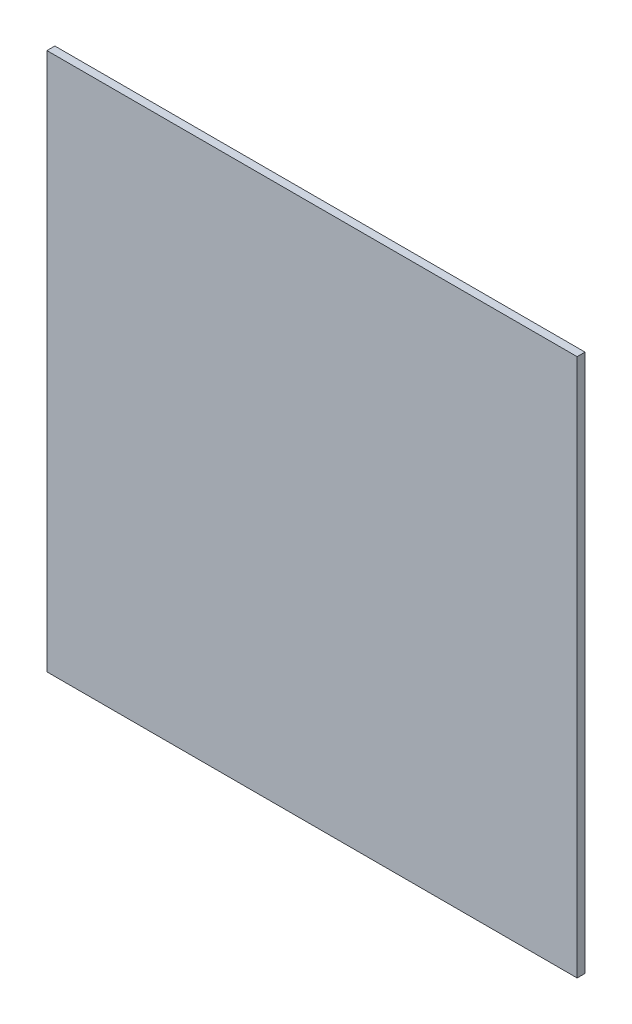
ISO-10303-21;
HEADER;
FILE_DESCRIPTION(('STEP AP214'),'2;1');
FILE_NAME('part.step','',(''),(''),'','','');
FILE_SCHEMA(('AUTOMOTIVE_DESIGN { 1 0 10303 214 1 1 1 1 }'));
ENDSEC;
DATA;
#1=APPLICATION_CONTEXT('core data for automotive mechanical design processes');
#2=APPLICATION_PROTOCOL_DEFINITION('international standard','automotive_design',2000,#1);
#3=PRODUCT_CONTEXT('',#1,'mechanical');
#4=PRODUCT('Part','Part','',(#3));
#5=PRODUCT_RELATED_PRODUCT_CATEGORY('part','',(#4));
#6=PRODUCT_DEFINITION_FORMATION('','',#4);
#7=PRODUCT_DEFINITION_CONTEXT('part definition',#1,'design');
#8=PRODUCT_DEFINITION('design','',#6,#7);
#9=PRODUCT_DEFINITION_SHAPE('','',#8);
#10=(LENGTH_UNIT() NAMED_UNIT(*) SI_UNIT(.MILLI.,.METRE.));
#11=(NAMED_UNIT(*) PLANE_ANGLE_UNIT() SI_UNIT($,.RADIAN.));
#12=(NAMED_UNIT(*) SI_UNIT($,.STERADIAN.) SOLID_ANGLE_UNIT());
#13=UNCERTAINTY_MEASURE_WITH_UNIT(LENGTH_MEASURE(1.E-05),#10,'distance_accuracy_value','');
#14=(GEOMETRIC_REPRESENTATION_CONTEXT(3) GLOBAL_UNCERTAINTY_ASSIGNED_CONTEXT((#13)) GLOBAL_UNIT_ASSIGNED_CONTEXT((#10,
#11,#12)) REPRESENTATION_CONTEXT('',''));
#15=CARTESIAN_POINT('',(0.,0.,0.));
#16=DIRECTION('',(0.,0.,1.));
#17=DIRECTION('',(1.,0.,0.));
#18=AXIS2_PLACEMENT_3D('',#15,#16,#17);
#19=CARTESIAN_POINT('',(0.,0.,10.));
#20=DIRECTION('',(1.,0.,0.));
#21=DIRECTION('',(0.,0.,-1.));
#22=AXIS2_PLACEMENT_3D('',#19,#20,#21);
#23=PLANE('',#22);
#24=DIRECTION('',(0.,-1.,0.));
#25=VECTOR('',#24,1.);
#26=CARTESIAN_POINT('',(0.,0.,0.));
#27=LINE('',#26,#25);
#28=CARTESIAN_POINT('',(0.,680.,0.));
#29=VERTEX_POINT('',#28);
#30=CARTESIAN_POINT('',(0.,0.,0.));
#31=VERTEX_POINT('',#30);
#32=EDGE_CURVE('E94',#29,#31,#27,.T.);
#33=ORIENTED_EDGE('',*,*,#32,.T.);
#34=DIRECTION('',(0.,0.,-1.));
#35=VECTOR('',#34,1.);
#36=CARTESIAN_POINT('',(0.,0.,10.));
#37=LINE('',#36,#35);
#38=CARTESIAN_POINT('',(0.,0.,10.));
#39=VERTEX_POINT('',#38);
#40=EDGE_CURVE('E11',#39,#31,#37,.T.);
#41=ORIENTED_EDGE('',*,*,#40,.F.);
#42=DIRECTION('',(0.,-1.,0.));
#43=VECTOR('',#42,1.);
#44=CARTESIAN_POINT('',(0.,0.,10.));
#45=LINE('',#44,#43);
#46=CARTESIAN_POINT('',(0.,680.,10.));
#47=VERTEX_POINT('',#46);
#48=EDGE_CURVE('E82',#47,#39,#45,.T.);
#49=ORIENTED_EDGE('',*,*,#48,.F.);
#50=DIRECTION('',(0.,0.,-1.));
#51=VECTOR('',#50,1.);
#52=CARTESIAN_POINT('',(0.,680.,10.));
#53=LINE('',#52,#51);
#54=EDGE_CURVE('E90',#47,#29,#53,.T.);
#55=ORIENTED_EDGE('',*,*,#54,.T.);
#56=EDGE_LOOP('',(#33,#41,#49,#55));
#57=FACE_BOUND('',#56,.T.);
#58=ADVANCED_FACE('F31',(#57),#23,.F.);
#59=CARTESIAN_POINT('',(0.,0.,10.));
#60=DIRECTION('',(0.,1.,0.));
#61=DIRECTION('',(0.,0.,1.));
#62=AXIS2_PLACEMENT_3D('',#59,#60,#61);
#63=PLANE('',#62);
#64=DIRECTION('',(1.,0.,0.));
#65=VECTOR('',#64,1.);
#66=CARTESIAN_POINT('',(0.,0.,0.));
#67=LINE('',#66,#65);
#68=CARTESIAN_POINT('',(670.,0.,0.));
#69=VERTEX_POINT('',#68);
#70=EDGE_CURVE('E86',#31,#69,#67,.T.);
#71=ORIENTED_EDGE('',*,*,#70,.T.);
#72=DIRECTION('',(0.,0.,-1.));
#73=VECTOR('',#72,1.);
#74=CARTESIAN_POINT('',(670.,0.,10.));
#75=LINE('',#74,#73);
#76=CARTESIAN_POINT('',(670.,0.,10.));
#77=VERTEX_POINT('',#76);
#78=EDGE_CURVE('E39',#77,#69,#75,.T.);
#79=ORIENTED_EDGE('',*,*,#78,.F.);
#80=DIRECTION('',(1.,0.,0.));
#81=VECTOR('',#80,1.);
#82=CARTESIAN_POINT('',(0.,0.,10.));
#83=LINE('',#82,#81);
#84=EDGE_CURVE('E77',#39,#77,#83,.T.);
#85=ORIENTED_EDGE('',*,*,#84,.F.);
#86=ORIENTED_EDGE('',*,*,#40,.T.);
#87=EDGE_LOOP('',(#71,#79,#85,#86));
#88=FACE_BOUND('',#87,.T.);
#89=ADVANCED_FACE('F85',(#88),#63,.F.);
#90=CARTESIAN_POINT('',(670.,0.,10.));
#91=DIRECTION('',(-1.,0.,0.));
#92=DIRECTION('',(0.,0.,1.));
#93=AXIS2_PLACEMENT_3D('',#90,#91,#92);
#94=PLANE('',#93);
#95=DIRECTION('',(0.,1.,0.));
#96=VECTOR('',#95,1.);
#97=CARTESIAN_POINT('',(670.,0.,0.));
#98=LINE('',#97,#96);
#99=CARTESIAN_POINT('',(670.,680.,0.));
#100=VERTEX_POINT('',#99);
#101=EDGE_CURVE('E64',#69,#100,#98,.T.);
#102=ORIENTED_EDGE('',*,*,#101,.T.);
#103=DIRECTION('',(0.,0.,-1.));
#104=VECTOR('',#103,1.);
#105=CARTESIAN_POINT('',(670.,680.,10.));
#106=LINE('',#105,#104);
#107=CARTESIAN_POINT('',(670.,680.,10.));
#108=VERTEX_POINT('',#107);
#109=EDGE_CURVE('E87',#108,#100,#106,.T.);
#110=ORIENTED_EDGE('',*,*,#109,.F.);
#111=DIRECTION('',(0.,1.,0.));
#112=VECTOR('',#111,1.);
#113=CARTESIAN_POINT('',(670.,0.,10.));
#114=LINE('',#113,#112);
#115=EDGE_CURVE('E80',#77,#108,#114,.T.);
#116=ORIENTED_EDGE('',*,*,#115,.F.);
#117=ORIENTED_EDGE('',*,*,#78,.T.);
#118=EDGE_LOOP('',(#102,#110,#116,#117));
#119=FACE_BOUND('',#118,.T.);
#120=ADVANCED_FACE('F88',(#119),#94,.F.);
#121=CARTESIAN_POINT('',(0.,680.,10.));
#122=DIRECTION('',(0.,-1.,0.));
#123=DIRECTION('',(0.,0.,-1.));
#124=AXIS2_PLACEMENT_3D('',#121,#122,#123);
#125=PLANE('',#124);
#126=DIRECTION('',(-1.,0.,0.));
#127=VECTOR('',#126,1.);
#128=CARTESIAN_POINT('',(0.,680.,0.));
#129=LINE('',#128,#127);
#130=EDGE_CURVE('E70',#100,#29,#129,.T.);
#131=ORIENTED_EDGE('',*,*,#130,.T.);
#132=ORIENTED_EDGE('',*,*,#54,.F.);
#133=DIRECTION('',(-1.,0.,0.));
#134=VECTOR('',#133,1.);
#135=CARTESIAN_POINT('',(0.,680.,10.));
#136=LINE('',#135,#134);
#137=EDGE_CURVE('E47',#108,#47,#136,.T.);
#138=ORIENTED_EDGE('',*,*,#137,.F.);
#139=ORIENTED_EDGE('',*,*,#109,.T.);
#140=EDGE_LOOP('',(#131,#132,#138,#139));
#141=FACE_BOUND('',#140,.T.);
#142=ADVANCED_FACE('F101',(#141),#125,.F.);
#143=CARTESIAN_POINT('',(0.,680.,10.));
#144=DIRECTION('',(0.,0.,-1.));
#145=DIRECTION('',(-1.,0.,0.));
#146=AXIS2_PLACEMENT_3D('',#143,#144,#145);
#147=PLANE('',#146);
#148=ORIENTED_EDGE('',*,*,#48,.T.);
#149=ORIENTED_EDGE('',*,*,#84,.T.);
#150=ORIENTED_EDGE('',*,*,#115,.T.);
#151=ORIENTED_EDGE('',*,*,#137,.T.);
#152=EDGE_LOOP('',(#148,#149,#150,#151));
#153=FACE_BOUND('',#152,.T.);
#154=ADVANCED_FACE('F78',(#153),#147,.F.);
#155=CARTESIAN_POINT('',(0.,680.,0.));
#156=DIRECTION('',(0.,0.,-1.));
#157=DIRECTION('',(-1.,0.,0.));
#158=AXIS2_PLACEMENT_3D('',#155,#156,#157);
#159=PLANE('',#158);
#160=ORIENTED_EDGE('',*,*,#32,.F.);
#161=ORIENTED_EDGE('',*,*,#130,.F.);
#162=ORIENTED_EDGE('',*,*,#101,.F.);
#163=ORIENTED_EDGE('',*,*,#70,.F.);
#164=EDGE_LOOP('',(#160,#161,#162,#163));
#165=FACE_BOUND('',#164,.T.);
#166=ADVANCED_FACE('F104',(#165),#159,.T.);
#167=CLOSED_SHELL('',(#58,#89,#120,#142,#154,#166));
#168=MANIFOLD_SOLID_BREP('B2',#167);
#169=ADVANCED_BREP_SHAPE_REPRESENTATION('',(#18,#168),#14);
#170=SHAPE_DEFINITION_REPRESENTATION(#9,#169);
ENDSEC;
END-ISO-10303-21;
